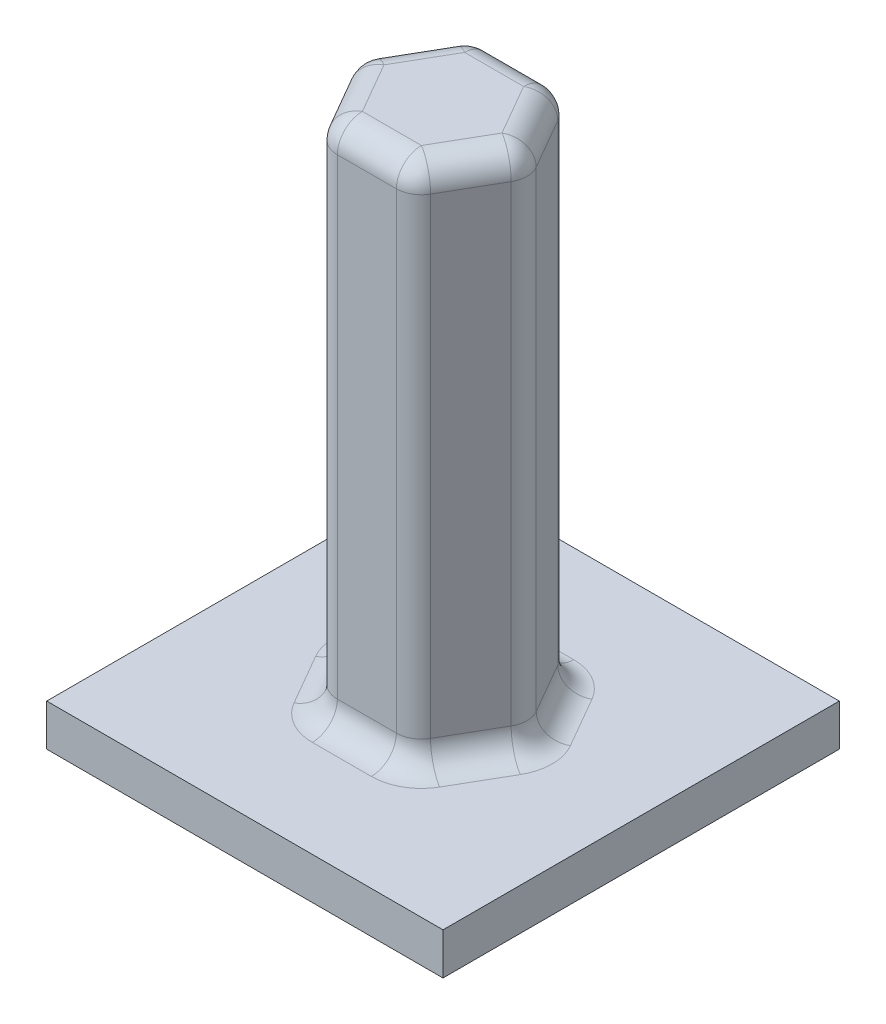
ISO-10303-21;
HEADER;
FILE_DESCRIPTION(('STEP AP214'),'2;1');
FILE_NAME('part.step','',(''),(''),'','','');
FILE_SCHEMA(('AUTOMOTIVE_DESIGN { 1 0 10303 214 1 1 1 1 }'));
ENDSEC;
DATA;
#1=APPLICATION_CONTEXT('core data for automotive mechanical design processes');
#2=APPLICATION_PROTOCOL_DEFINITION('international standard','automotive_design',2000,#1);
#3=PRODUCT_CONTEXT('',#1,'mechanical');
#4=PRODUCT('Part','Part','',(#3));
#5=PRODUCT_RELATED_PRODUCT_CATEGORY('part','',(#4));
#6=PRODUCT_DEFINITION_FORMATION('','',#4);
#7=PRODUCT_DEFINITION_CONTEXT('part definition',#1,'design');
#8=PRODUCT_DEFINITION('design','',#6,#7);
#9=PRODUCT_DEFINITION_SHAPE('','',#8);
#10=(LENGTH_UNIT() NAMED_UNIT(*) SI_UNIT(.MILLI.,.METRE.));
#11=(NAMED_UNIT(*) PLANE_ANGLE_UNIT() SI_UNIT($,.RADIAN.));
#12=(NAMED_UNIT(*) SI_UNIT($,.STERADIAN.) SOLID_ANGLE_UNIT());
#13=UNCERTAINTY_MEASURE_WITH_UNIT(LENGTH_MEASURE(1.E-05),#10,'distance_accuracy_value','');
#14=(GEOMETRIC_REPRESENTATION_CONTEXT(3) GLOBAL_UNCERTAINTY_ASSIGNED_CONTEXT((#13)) GLOBAL_UNIT_ASSIGNED_CONTEXT((#10,
#11,#12)) REPRESENTATION_CONTEXT('',''));
#15=CARTESIAN_POINT('',(0.,0.,0.));
#16=DIRECTION('',(0.,0.,1.));
#17=DIRECTION('',(1.,0.,0.));
#18=AXIS2_PLACEMENT_3D('',#15,#16,#17);
#19=CARTESIAN_POINT('',(0.,2.,0.));
#20=DIRECTION('',(0.,-1.,0.));
#21=DIRECTION('',(0.,0.,-1.));
#22=AXIS2_PLACEMENT_3D('',#19,#20,#21);
#23=PLANE('',#22);
#24=CARTESIAN_POINT('',(-2.82901631902917,2.,0.));
#25=DIRECTION('',(0.,-1.,0.));
#26=DIRECTION('',(0.,0.,-1.));
#27=AXIS2_PLACEMENT_3D('',#24,#25,#26);
#28=CIRCLE('',#27,2.4);
#29=CARTESIAN_POINT('',(-4.90747728811182,2.,-1.2));
#30=VERTEX_POINT('',#29);
#31=CARTESIAN_POINT('',(-4.90747728811182,2.,1.2));
#32=VERTEX_POINT('',#31);
#33=EDGE_CURVE('E253',#30,#32,#28,.F.);
#34=ORIENTED_EDGE('',*,*,#33,.F.);
#35=DIRECTION('',(-0.5,0.,0.866025403784439));
#36=VECTOR('',#35,1.);
#37=CARTESIAN_POINT('',(-3.14655896708346,2.,-4.25));
#38=LINE('',#37,#36);
#39=CARTESIAN_POINT('',(-3.49296912859723,2.,-3.65));
#40=VERTEX_POINT('',#39);
#41=EDGE_CURVE('E280',#30,#40,#38,.F.);
#42=ORIENTED_EDGE('',*,*,#41,.T.);
#43=CARTESIAN_POINT('',(-1.41450815951458,2.,-2.45));
#44=DIRECTION('',(0.,-1.,0.));
#45=DIRECTION('',(0.,0.,-1.));
#46=AXIS2_PLACEMENT_3D('',#43,#44,#45);
#47=CIRCLE('',#46,2.4);
#48=CARTESIAN_POINT('',(-1.41450815951458,2.,-4.85));
#49=VERTEX_POINT('',#48);
#50=EDGE_CURVE('E278',#49,#40,#47,.F.);
#51=ORIENTED_EDGE('',*,*,#50,.F.);
#52=DIRECTION('',(-1.,0.,0.));
#53=VECTOR('',#52,1.);
#54=CARTESIAN_POINT('',(2.10732848254213,2.,-4.85));
#55=LINE('',#54,#53);
#56=CARTESIAN_POINT('',(1.41450815951458,2.,-4.85));
#57=VERTEX_POINT('',#56);
#58=EDGE_CURVE('E276',#49,#57,#55,.F.);
#59=ORIENTED_EDGE('',*,*,#58,.T.);
#60=CARTESIAN_POINT('',(1.41450815951458,2.,-2.45));
#61=DIRECTION('',(0.,-1.,0.));
#62=DIRECTION('',(0.,0.,-1.));
#63=AXIS2_PLACEMENT_3D('',#60,#61,#62);
#64=CIRCLE('',#63,2.4);
#65=CARTESIAN_POINT('',(3.49296912859723,2.,-3.65));
#66=VERTEX_POINT('',#65);
#67=EDGE_CURVE('E273',#66,#57,#64,.F.);
#68=ORIENTED_EDGE('',*,*,#67,.F.);
#69=DIRECTION('',(-0.5,0.,-0.866025403784439));
#70=VECTOR('',#69,1.);
#71=CARTESIAN_POINT('',(5.2538874496256,2.,-0.6));
#72=LINE('',#71,#70);
#73=CARTESIAN_POINT('',(4.90747728811182,2.,-1.2));
#74=VERTEX_POINT('',#73);
#75=EDGE_CURVE('E271',#66,#74,#72,.F.);
#76=ORIENTED_EDGE('',*,*,#75,.T.);
#77=CARTESIAN_POINT('',(2.82901631902917,2.,0.));
#78=DIRECTION('',(0.,-1.,0.));
#79=DIRECTION('',(0.,0.,-1.));
#80=AXIS2_PLACEMENT_3D('',#77,#78,#79);
#81=CIRCLE('',#80,2.4);
#82=CARTESIAN_POINT('',(4.90747728811182,2.,1.2));
#83=VERTEX_POINT('',#82);
#84=EDGE_CURVE('E268',#83,#74,#81,.F.);
#85=ORIENTED_EDGE('',*,*,#84,.F.);
#86=DIRECTION('',(0.5,0.,-0.866025403784439));
#87=VECTOR('',#86,1.);
#88=CARTESIAN_POINT('',(3.14655896708346,2.,4.25));
#89=LINE('',#88,#87);
#90=CARTESIAN_POINT('',(3.49296912859724,2.,3.65));
#91=VERTEX_POINT('',#90);
#92=EDGE_CURVE('E266',#83,#91,#89,.F.);
#93=ORIENTED_EDGE('',*,*,#92,.T.);
#94=CARTESIAN_POINT('',(1.41450815951459,2.,2.45));
#95=DIRECTION('',(0.,-1.,0.));
#96=DIRECTION('',(0.,0.,-1.));
#97=AXIS2_PLACEMENT_3D('',#94,#95,#96);
#98=CIRCLE('',#97,2.4);
#99=CARTESIAN_POINT('',(1.41450815951459,2.,4.85));
#100=VERTEX_POINT('',#99);
#101=EDGE_CURVE('E263',#100,#91,#98,.F.);
#102=ORIENTED_EDGE('',*,*,#101,.F.);
#103=DIRECTION('',(1.,0.,0.));
#104=VECTOR('',#103,1.);
#105=CARTESIAN_POINT('',(-2.10732848254213,2.,4.85));
#106=LINE('',#105,#104);
#107=CARTESIAN_POINT('',(-1.41450815951458,2.,4.85));
#108=VERTEX_POINT('',#107);
#109=EDGE_CURVE('E261',#100,#108,#106,.F.);
#110=ORIENTED_EDGE('',*,*,#109,.T.);
#111=CARTESIAN_POINT('',(-1.41450815951458,2.,2.45));
#112=DIRECTION('',(0.,-1.,0.));
#113=DIRECTION('',(0.,0.,-1.));
#114=AXIS2_PLACEMENT_3D('',#111,#112,#113);
#115=CIRCLE('',#114,2.4);
#116=CARTESIAN_POINT('',(-3.49296912859723,2.,3.65));
#117=VERTEX_POINT('',#116);
#118=EDGE_CURVE('E258',#117,#108,#115,.F.);
#119=ORIENTED_EDGE('',*,*,#118,.F.);
#120=DIRECTION('',(0.5,0.,0.866025403784439));
#121=VECTOR('',#120,1.);
#122=CARTESIAN_POINT('',(-5.25388744962559,2.,0.599999999999999));
#123=LINE('',#122,#121);
#124=EDGE_CURVE('E256',#117,#32,#123,.F.);
#125=ORIENTED_EDGE('',*,*,#124,.T.);
#126=EDGE_LOOP('',(#34,#42,#51,#59,#68,#76,#85,#93,#102,#110,#119,#125));
#127=FACE_BOUND('',#126,.T.);
#128=DIRECTION('',(0.,0.,-1.));
#129=VECTOR('',#128,1.);
#130=CARTESIAN_POINT('',(9.5,2.,9.5));
#131=LINE('',#130,#129);
#132=CARTESIAN_POINT('',(9.5,2.,9.5));
#133=VERTEX_POINT('',#132);
#134=CARTESIAN_POINT('',(9.5,2.,-9.5));
#135=VERTEX_POINT('',#134);
#136=EDGE_CURVE('E213',#133,#135,#131,.T.);
#137=ORIENTED_EDGE('',*,*,#136,.T.);
#138=DIRECTION('',(-1.,0.,0.));
#139=VECTOR('',#138,1.);
#140=CARTESIAN_POINT('',(-9.5,2.,-9.5));
#141=LINE('',#140,#139);
#142=CARTESIAN_POINT('',(-9.5,2.,-9.5));
#143=VERTEX_POINT('',#142);
#144=EDGE_CURVE('E202',#135,#143,#141,.T.);
#145=ORIENTED_EDGE('',*,*,#144,.T.);
#146=DIRECTION('',(0.,0.,1.));
#147=VECTOR('',#146,1.);
#148=CARTESIAN_POINT('',(-9.5,2.,9.5));
#149=LINE('',#148,#147);
#150=CARTESIAN_POINT('',(-9.5,2.,9.5));
#151=VERTEX_POINT('',#150);
#152=EDGE_CURVE('E212',#143,#151,#149,.T.);
#153=ORIENTED_EDGE('',*,*,#152,.T.);
#154=DIRECTION('',(1.,0.,0.));
#155=VECTOR('',#154,1.);
#156=CARTESIAN_POINT('',(-9.5,2.,9.5));
#157=LINE('',#156,#155);
#158=EDGE_CURVE('E217',#151,#133,#157,.T.);
#159=ORIENTED_EDGE('',*,*,#158,.T.);
#160=EDGE_LOOP('',(#137,#145,#153,#159));
#161=FACE_BOUND('',#160,.T.);
#162=ADVANCED_FACE('F35',(#127,#161),#23,.F.);
#163=CARTESIAN_POINT('',(9.5,2.,9.5));
#164=DIRECTION('',(-1.,0.,0.));
#165=DIRECTION('',(0.,0.,1.));
#166=AXIS2_PLACEMENT_3D('',#163,#164,#165);
#167=PLANE('',#166);
#168=DIRECTION('',(0.,0.,-1.));
#169=VECTOR('',#168,1.);
#170=CARTESIAN_POINT('',(9.5,0.,9.5));
#171=LINE('',#170,#169);
#172=CARTESIAN_POINT('',(9.5,0.,9.5));
#173=VERTEX_POINT('',#172);
#174=CARTESIAN_POINT('',(9.5,0.,-9.5));
#175=VERTEX_POINT('',#174);
#176=EDGE_CURVE('E225',#173,#175,#171,.T.);
#177=ORIENTED_EDGE('',*,*,#176,.T.);
#178=DIRECTION('',(0.,-1.,0.));
#179=VECTOR('',#178,1.);
#180=CARTESIAN_POINT('',(9.5,2.,-9.5));
#181=LINE('',#180,#179);
#182=EDGE_CURVE('E206',#135,#175,#181,.T.);
#183=ORIENTED_EDGE('',*,*,#182,.F.);
#184=ORIENTED_EDGE('',*,*,#136,.F.);
#185=DIRECTION('',(0.,-1.,0.));
#186=VECTOR('',#185,1.);
#187=CARTESIAN_POINT('',(9.5,2.,9.5));
#188=LINE('',#187,#186);
#189=EDGE_CURVE('E435',#133,#173,#188,.T.);
#190=ORIENTED_EDGE('',*,*,#189,.T.);
#191=EDGE_LOOP('',(#177,#183,#184,#190));
#192=FACE_BOUND('',#191,.T.);
#193=ADVANCED_FACE('F223',(#192),#167,.F.);
#194=CARTESIAN_POINT('',(-9.5,2.,-9.5));
#195=DIRECTION('',(0.,0.,1.));
#196=DIRECTION('',(1.,0.,0.));
#197=AXIS2_PLACEMENT_3D('',#194,#195,#196);
#198=PLANE('',#197);
#199=DIRECTION('',(-1.,0.,0.));
#200=VECTOR('',#199,1.);
#201=CARTESIAN_POINT('',(-9.5,0.,-9.5));
#202=LINE('',#201,#200);
#203=CARTESIAN_POINT('',(-9.5,0.,-9.5));
#204=VERTEX_POINT('',#203);
#205=EDGE_CURVE('E426',#175,#204,#202,.T.);
#206=ORIENTED_EDGE('',*,*,#205,.T.);
#207=DIRECTION('',(0.,-1.,0.));
#208=VECTOR('',#207,1.);
#209=CARTESIAN_POINT('',(-9.5,2.,-9.5));
#210=LINE('',#209,#208);
#211=EDGE_CURVE('E209',#143,#204,#210,.T.);
#212=ORIENTED_EDGE('',*,*,#211,.F.);
#213=ORIENTED_EDGE('',*,*,#144,.F.);
#214=ORIENTED_EDGE('',*,*,#182,.T.);
#215=EDGE_LOOP('',(#206,#212,#213,#214));
#216=FACE_BOUND('',#215,.T.);
#217=ADVANCED_FACE('F204',(#216),#198,.F.);
#218=CARTESIAN_POINT('',(-9.5,2.,9.5));
#219=DIRECTION('',(1.,0.,0.));
#220=DIRECTION('',(0.,0.,-1.));
#221=AXIS2_PLACEMENT_3D('',#218,#219,#220);
#222=PLANE('',#221);
#223=DIRECTION('',(0.,0.,1.));
#224=VECTOR('',#223,1.);
#225=CARTESIAN_POINT('',(-9.5,0.,9.5));
#226=LINE('',#225,#224);
#227=CARTESIAN_POINT('',(-9.5,0.,9.5));
#228=VERTEX_POINT('',#227);
#229=EDGE_CURVE('E428',#204,#228,#226,.T.);
#230=ORIENTED_EDGE('',*,*,#229,.T.);
#231=DIRECTION('',(0.,-1.,0.));
#232=VECTOR('',#231,1.);
#233=CARTESIAN_POINT('',(-9.5,2.,9.5));
#234=LINE('',#233,#232);
#235=EDGE_CURVE('E230',#151,#228,#234,.T.);
#236=ORIENTED_EDGE('',*,*,#235,.F.);
#237=ORIENTED_EDGE('',*,*,#152,.F.);
#238=ORIENTED_EDGE('',*,*,#211,.T.);
#239=EDGE_LOOP('',(#230,#236,#237,#238));
#240=FACE_BOUND('',#239,.T.);
#241=ADVANCED_FACE('F445',(#240),#222,.F.);
#242=CARTESIAN_POINT('',(-9.5,2.,9.5));
#243=DIRECTION('',(0.,0.,-1.));
#244=DIRECTION('',(-1.,0.,0.));
#245=AXIS2_PLACEMENT_3D('',#242,#243,#244);
#246=PLANE('',#245);
#247=DIRECTION('',(1.,0.,0.));
#248=VECTOR('',#247,1.);
#249=CARTESIAN_POINT('',(-9.5,0.,9.5));
#250=LINE('',#249,#248);
#251=EDGE_CURVE('E221',#228,#173,#250,.T.);
#252=ORIENTED_EDGE('',*,*,#251,.T.);
#253=ORIENTED_EDGE('',*,*,#189,.F.);
#254=ORIENTED_EDGE('',*,*,#158,.F.);
#255=ORIENTED_EDGE('',*,*,#235,.T.);
#256=EDGE_LOOP('',(#252,#253,#254,#255));
#257=FACE_BOUND('',#256,.T.);
#258=ADVANCED_FACE('F440',(#257),#246,.F.);
#259=CARTESIAN_POINT('',(0.,0.,0.));
#260=DIRECTION('',(0.,-1.,0.));
#261=DIRECTION('',(0.,0.,-1.));
#262=AXIS2_PLACEMENT_3D('',#259,#260,#261);
#263=PLANE('',#262);
#264=ORIENTED_EDGE('',*,*,#176,.F.);
#265=ORIENTED_EDGE('',*,*,#251,.F.);
#266=ORIENTED_EDGE('',*,*,#229,.F.);
#267=ORIENTED_EDGE('',*,*,#205,.F.);
#268=EDGE_LOOP('',(#264,#265,#266,#267));
#269=FACE_BOUND('',#268,.T.);
#270=ADVANCED_FACE('F444',(#269),#263,.T.);
#271=CARTESIAN_POINT('',(2.10732848254214,27.,3.65));
#272=DIRECTION('',(-0.866025403784439,0.,-0.5));
#273=DIRECTION('',(-0.5,0.,0.866025403784439));
#274=AXIS2_PLACEMENT_3D('',#271,#272,#273);
#275=PLANE('',#274);
#276=DIRECTION('',(0.,-1.,0.));
#277=VECTOR('',#276,1.);
#278=CARTESIAN_POINT('',(3.86824680357049,27.,0.600000000000001));
#279=LINE('',#278,#277);
#280=CARTESIAN_POINT('',(3.86824680357049,3.2,0.600000000000001));
#281=VERTEX_POINT('',#280);
#282=CARTESIAN_POINT('',(3.86824680357049,25.8,0.600000000000001));
#283=VERTEX_POINT('',#282);
#284=EDGE_CURVE('E305',#281,#283,#279,.F.);
#285=ORIENTED_EDGE('',*,*,#284,.T.);
#286=DIRECTION('',(0.5,0.,-0.866025403784439));
#287=VECTOR('',#286,1.);
#288=CARTESIAN_POINT('',(2.10732848254214,25.8,3.65));
#289=LINE('',#288,#287);
#290=CARTESIAN_POINT('',(2.45373864405591,25.8,3.05));
#291=VERTEX_POINT('',#290);
#292=EDGE_CURVE('E307',#283,#291,#289,.F.);
#293=ORIENTED_EDGE('',*,*,#292,.T.);
#294=DIRECTION('',(0.,-1.,0.));
#295=VECTOR('',#294,1.);
#296=CARTESIAN_POINT('',(2.45373864405591,27.,3.05));
#297=LINE('',#296,#295);
#298=CARTESIAN_POINT('',(2.45373864405591,3.2,3.05));
#299=VERTEX_POINT('',#298);
#300=EDGE_CURVE('E301',#291,#299,#297,.T.);
#301=ORIENTED_EDGE('',*,*,#300,.T.);
#302=DIRECTION('',(0.5,0.,-0.866025403784439));
#303=VECTOR('',#302,1.);
#304=CARTESIAN_POINT('',(4.21465696508427,3.2,0.));
#305=LINE('',#304,#303);
#306=EDGE_CURVE('E303',#299,#281,#305,.T.);
#307=ORIENTED_EDGE('',*,*,#306,.T.);
#308=EDGE_LOOP('',(#285,#293,#301,#307));
#309=FACE_BOUND('',#308,.T.);
#310=ADVANCED_FACE('F463',(#309),#275,.F.);
#311=CARTESIAN_POINT('',(4.21465696508427,27.,0.));
#312=DIRECTION('',(-0.866025403784438,0.,0.5));
#313=DIRECTION('',(0.5,0.,0.866025403784439));
#314=AXIS2_PLACEMENT_3D('',#311,#312,#313);
#315=PLANE('',#314);
#316=DIRECTION('',(0.,-1.,0.));
#317=VECTOR('',#316,1.);
#318=CARTESIAN_POINT('',(2.45373864405591,27.,-3.05));
#319=LINE('',#318,#317);
#320=CARTESIAN_POINT('',(2.45373864405591,3.2,-3.05));
#321=VERTEX_POINT('',#320);
#322=CARTESIAN_POINT('',(2.45373864405591,25.8,-3.05));
#323=VERTEX_POINT('',#322);
#324=EDGE_CURVE('E296',#321,#323,#319,.F.);
#325=ORIENTED_EDGE('',*,*,#324,.T.);
#326=DIRECTION('',(-0.5,0.,-0.866025403784439));
#327=VECTOR('',#326,1.);
#328=CARTESIAN_POINT('',(4.21465696508427,25.8,0.));
#329=LINE('',#328,#327);
#330=CARTESIAN_POINT('',(3.86824680357049,25.8,-0.6));
#331=VERTEX_POINT('',#330);
#332=EDGE_CURVE('E298',#323,#331,#329,.F.);
#333=ORIENTED_EDGE('',*,*,#332,.T.);
#334=DIRECTION('',(0.,-1.,0.));
#335=VECTOR('',#334,1.);
#336=CARTESIAN_POINT('',(3.86824680357049,27.,-0.6));
#337=LINE('',#336,#335);
#338=CARTESIAN_POINT('',(3.86824680357049,3.2,-0.6));
#339=VERTEX_POINT('',#338);
#340=EDGE_CURVE('E292',#331,#339,#337,.T.);
#341=ORIENTED_EDGE('',*,*,#340,.T.);
#342=DIRECTION('',(-0.5,0.,-0.866025403784439));
#343=VECTOR('',#342,1.);
#344=CARTESIAN_POINT('',(2.10732848254213,3.2,-3.65));
#345=LINE('',#344,#343);
#346=EDGE_CURVE('E294',#339,#321,#345,.T.);
#347=ORIENTED_EDGE('',*,*,#346,.T.);
#348=EDGE_LOOP('',(#325,#333,#341,#347));
#349=FACE_BOUND('',#348,.T.);
#350=ADVANCED_FACE('F469',(#349),#315,.F.);
#351=CARTESIAN_POINT('',(2.10732848254213,27.,-3.65));
#352=DIRECTION('',(0.,0.,1.));
#353=DIRECTION('',(1.,0.,0.));
#354=AXIS2_PLACEMENT_3D('',#351,#352,#353);
#355=PLANE('',#354);
#356=DIRECTION('',(0.,-1.,0.));
#357=VECTOR('',#356,1.);
#358=CARTESIAN_POINT('',(-1.41450815951458,27.,-3.65));
#359=LINE('',#358,#357);
#360=CARTESIAN_POINT('',(-1.41450815951458,3.2,-3.65));
#361=VERTEX_POINT('',#360);
#362=CARTESIAN_POINT('',(-1.41450815951458,25.8,-3.65));
#363=VERTEX_POINT('',#362);
#364=EDGE_CURVE('E287',#361,#363,#359,.F.);
#365=ORIENTED_EDGE('',*,*,#364,.T.);
#366=DIRECTION('',(-1.,0.,0.));
#367=VECTOR('',#366,1.);
#368=CARTESIAN_POINT('',(2.10732848254213,25.8,-3.65));
#369=LINE('',#368,#367);
#370=CARTESIAN_POINT('',(1.41450815951458,25.8,-3.65));
#371=VERTEX_POINT('',#370);
#372=EDGE_CURVE('E289',#363,#371,#369,.F.);
#373=ORIENTED_EDGE('',*,*,#372,.T.);
#374=DIRECTION('',(0.,-1.,0.));
#375=VECTOR('',#374,1.);
#376=CARTESIAN_POINT('',(1.41450815951458,27.,-3.65));
#377=LINE('',#376,#375);
#378=CARTESIAN_POINT('',(1.41450815951458,3.2,-3.65));
#379=VERTEX_POINT('',#378);
#380=EDGE_CURVE('E283',#371,#379,#377,.T.);
#381=ORIENTED_EDGE('',*,*,#380,.T.);
#382=DIRECTION('',(-1.,0.,0.));
#383=VECTOR('',#382,1.);
#384=CARTESIAN_POINT('',(-2.10732848254213,3.2,-3.65));
#385=LINE('',#384,#383);
#386=EDGE_CURVE('E285',#379,#361,#385,.T.);
#387=ORIENTED_EDGE('',*,*,#386,.T.);
#388=EDGE_LOOP('',(#365,#373,#381,#387));
#389=FACE_BOUND('',#388,.T.);
#390=ADVANCED_FACE('F474',(#389),#355,.F.);
#391=CARTESIAN_POINT('',(-2.10732848254213,27.,-3.65));
#392=DIRECTION('',(0.866025403784438,0.,0.5));
#393=DIRECTION('',(0.5,0.,-0.866025403784439));
#394=AXIS2_PLACEMENT_3D('',#391,#392,#393);
#395=PLANE('',#394);
#396=DIRECTION('',(-0.5,0.,0.866025403784439));
#397=VECTOR('',#396,1.);
#398=CARTESIAN_POINT('',(-2.10732848254213,25.8,-3.65));
#399=LINE('',#398,#397);
#400=CARTESIAN_POINT('',(-3.86824680357049,25.8,-0.600000000000002));
#401=VERTEX_POINT('',#400);
#402=CARTESIAN_POINT('',(-2.45373864405591,25.8,-3.05));
#403=VERTEX_POINT('',#402);
#404=EDGE_CURVE('E248',#401,#403,#399,.F.);
#405=ORIENTED_EDGE('',*,*,#404,.T.);
#406=DIRECTION('',(0.,-1.,0.));
#407=VECTOR('',#406,1.);
#408=CARTESIAN_POINT('',(-2.45373864405591,27.,-3.05));
#409=LINE('',#408,#407);
#410=CARTESIAN_POINT('',(-2.45373864405591,3.2,-3.05));
#411=VERTEX_POINT('',#410);
#412=EDGE_CURVE('E251',#403,#411,#409,.T.);
#413=ORIENTED_EDGE('',*,*,#412,.T.);
#414=DIRECTION('',(-0.5,0.,0.866025403784439));
#415=VECTOR('',#414,1.);
#416=CARTESIAN_POINT('',(-4.21465696508427,3.2,0.));
#417=LINE('',#416,#415);
#418=CARTESIAN_POINT('',(-3.86824680357049,3.2,-0.600000000000002));
#419=VERTEX_POINT('',#418);
#420=EDGE_CURVE('E246',#411,#419,#417,.T.);
#421=ORIENTED_EDGE('',*,*,#420,.T.);
#422=DIRECTION('',(0.,-1.,0.));
#423=VECTOR('',#422,1.);
#424=CARTESIAN_POINT('',(-3.86824680357049,27.,-0.600000000000002));
#425=LINE('',#424,#423);
#426=EDGE_CURVE('E244',#419,#401,#425,.F.);
#427=ORIENTED_EDGE('',*,*,#426,.T.);
#428=EDGE_LOOP('',(#405,#413,#421,#427));
#429=FACE_BOUND('',#428,.T.);
#430=ADVANCED_FACE('F794',(#429),#395,.F.);
#431=CARTESIAN_POINT('',(-4.21465696508427,27.,0.));
#432=DIRECTION('',(0.866025403784438,0.,-0.5));
#433=DIRECTION('',(-0.5,0.,-0.866025403784439));
#434=AXIS2_PLACEMENT_3D('',#431,#432,#433);
#435=PLANE('',#434);
#436=DIRECTION('',(0.5,0.,0.866025403784439));
#437=VECTOR('',#436,1.);
#438=CARTESIAN_POINT('',(-4.21465696508427,25.8,0.));
#439=LINE('',#438,#437);
#440=CARTESIAN_POINT('',(-2.45373864405591,25.8,3.05));
#441=VERTEX_POINT('',#440);
#442=CARTESIAN_POINT('',(-3.86824680357049,25.8,0.599999999999998));
#443=VERTEX_POINT('',#442);
#444=EDGE_CURVE('E44',#441,#443,#439,.F.);
#445=ORIENTED_EDGE('',*,*,#444,.T.);
#446=DIRECTION('',(0.,-1.,0.));
#447=VECTOR('',#446,1.);
#448=CARTESIAN_POINT('',(-3.86824680357049,27.,0.599999999999998));
#449=LINE('',#448,#447);
#450=CARTESIAN_POINT('',(-3.86824680357049,3.2,0.599999999999998));
#451=VERTEX_POINT('',#450);
#452=EDGE_CURVE('E11',#443,#451,#449,.T.);
#453=ORIENTED_EDGE('',*,*,#452,.T.);
#454=DIRECTION('',(0.5,0.,0.866025403784439));
#455=VECTOR('',#454,1.);
#456=CARTESIAN_POINT('',(-2.10732848254213,3.2,3.65));
#457=LINE('',#456,#455);
#458=CARTESIAN_POINT('',(-2.45373864405591,3.2,3.05));
#459=VERTEX_POINT('',#458);
#460=EDGE_CURVE('E319',#451,#459,#457,.T.);
#461=ORIENTED_EDGE('',*,*,#460,.T.);
#462=DIRECTION('',(0.,-1.,0.));
#463=VECTOR('',#462,1.);
#464=CARTESIAN_POINT('',(-2.45373864405591,27.,3.05));
#465=LINE('',#464,#463);
#466=EDGE_CURVE('E55',#459,#441,#465,.F.);
#467=ORIENTED_EDGE('',*,*,#466,.T.);
#468=EDGE_LOOP('',(#445,#453,#461,#467));
#469=FACE_BOUND('',#468,.T.);
#470=ADVANCED_FACE('F785',(#469),#435,.F.);
#471=CARTESIAN_POINT('',(-2.10732848254213,27.,3.65));
#472=DIRECTION('',(0.,0.,-1.));
#473=DIRECTION('',(-1.,0.,0.));
#474=AXIS2_PLACEMENT_3D('',#471,#472,#473);
#475=PLANE('',#474);
#476=DIRECTION('',(0.,-1.,0.));
#477=VECTOR('',#476,1.);
#478=CARTESIAN_POINT('',(1.41450815951459,27.,3.65));
#479=LINE('',#478,#477);
#480=CARTESIAN_POINT('',(1.41450815951459,3.2,3.65));
#481=VERTEX_POINT('',#480);
#482=CARTESIAN_POINT('',(1.41450815951459,25.8,3.65));
#483=VERTEX_POINT('',#482);
#484=EDGE_CURVE('E314',#481,#483,#479,.F.);
#485=ORIENTED_EDGE('',*,*,#484,.T.);
#486=DIRECTION('',(1.,0.,0.));
#487=VECTOR('',#486,1.);
#488=CARTESIAN_POINT('',(-2.10732848254213,25.8,3.65));
#489=LINE('',#488,#487);
#490=CARTESIAN_POINT('',(-1.41450815951458,25.8,3.65));
#491=VERTEX_POINT('',#490);
#492=EDGE_CURVE('E316',#483,#491,#489,.F.);
#493=ORIENTED_EDGE('',*,*,#492,.T.);
#494=DIRECTION('',(0.,-1.,0.));
#495=VECTOR('',#494,1.);
#496=CARTESIAN_POINT('',(-1.41450815951458,27.,3.65));
#497=LINE('',#496,#495);
#498=CARTESIAN_POINT('',(-1.41450815951458,3.2,3.65));
#499=VERTEX_POINT('',#498);
#500=EDGE_CURVE('E310',#491,#499,#497,.T.);
#501=ORIENTED_EDGE('',*,*,#500,.T.);
#502=DIRECTION('',(1.,0.,0.));
#503=VECTOR('',#502,1.);
#504=CARTESIAN_POINT('',(2.10732848254214,3.2,3.65));
#505=LINE('',#504,#503);
#506=EDGE_CURVE('E312',#499,#481,#505,.T.);
#507=ORIENTED_EDGE('',*,*,#506,.T.);
#508=EDGE_LOOP('',(#485,#493,#501,#507));
#509=FACE_BOUND('',#508,.T.);
#510=ADVANCED_FACE('F513',(#509),#475,.F.);
#511=CARTESIAN_POINT('',(0.,27.,0.));
#512=DIRECTION('',(0.,1.,0.));
#513=DIRECTION('',(0.,0.,1.));
#514=AXIS2_PLACEMENT_3D('',#511,#512,#513);
#515=PLANE('',#514);
#516=DIRECTION('',(-1.,0.,0.));
#517=VECTOR('',#516,1.);
#518=CARTESIAN_POINT('',(-2.10732848254213,27.,-2.45));
#519=LINE('',#518,#517);
#520=CARTESIAN_POINT('',(1.41450815951458,27.,-2.45));
#521=VERTEX_POINT('',#520);
#522=CARTESIAN_POINT('',(-1.41450815951458,27.,-2.45));
#523=VERTEX_POINT('',#522);
#524=EDGE_CURVE('E239',#521,#523,#519,.T.);
#525=ORIENTED_EDGE('',*,*,#524,.T.);
#526=DIRECTION('',(-0.5,0.,0.866025403784439));
#527=VECTOR('',#526,1.);
#528=CARTESIAN_POINT('',(-3.17542648054294,27.,0.599999999999999));
#529=LINE('',#528,#527);
#530=CARTESIAN_POINT('',(-2.82901631902917,27.,0.));
#531=VERTEX_POINT('',#530);
#532=EDGE_CURVE('E241',#523,#531,#529,.T.);
#533=ORIENTED_EDGE('',*,*,#532,.T.);
#534=DIRECTION('',(0.5,0.,0.866025403784439));
#535=VECTOR('',#534,1.);
#536=CARTESIAN_POINT('',(-1.06809799800081,27.,3.05));
#537=LINE('',#536,#535);
#538=CARTESIAN_POINT('',(-1.41450815951458,27.,2.45));
#539=VERTEX_POINT('',#538);
#540=EDGE_CURVE('E226',#531,#539,#537,.T.);
#541=ORIENTED_EDGE('',*,*,#540,.T.);
#542=DIRECTION('',(1.,0.,0.));
#543=VECTOR('',#542,1.);
#544=CARTESIAN_POINT('',(2.10732848254214,27.,2.45));
#545=LINE('',#544,#543);
#546=CARTESIAN_POINT('',(1.41450815951458,27.,2.45));
#547=VERTEX_POINT('',#546);
#548=EDGE_CURVE('E228',#539,#547,#545,.T.);
#549=ORIENTED_EDGE('',*,*,#548,.T.);
#550=DIRECTION('',(0.5,0.,-0.866025403784439));
#551=VECTOR('',#550,1.);
#552=CARTESIAN_POINT('',(3.17542648054294,27.,-0.6));
#553=LINE('',#552,#551);
#554=CARTESIAN_POINT('',(2.82901631902917,27.,0.));
#555=VERTEX_POINT('',#554);
#556=EDGE_CURVE('E235',#547,#555,#553,.T.);
#557=ORIENTED_EDGE('',*,*,#556,.T.);
#558=DIRECTION('',(-0.5,0.,-0.866025403784439));
#559=VECTOR('',#558,1.);
#560=CARTESIAN_POINT('',(1.06809799800081,27.,-3.05));
#561=LINE('',#560,#559);
#562=EDGE_CURVE('E237',#555,#521,#561,.T.);
#563=ORIENTED_EDGE('',*,*,#562,.T.);
#564=EDGE_LOOP('',(#525,#533,#541,#549,#557,#563));
#565=FACE_BOUND('',#564,.T.);
#566=ADVANCED_FACE('F499',(#565),#515,.T.);
#567=CARTESIAN_POINT('',(3.14655896708346,3.2,4.25));
#568=DIRECTION('',(-0.5,0.,0.866025403784439));
#569=DIRECTION('',(0.866025403784439,0.,0.5));
#570=AXIS2_PLACEMENT_3D('',#567,#568,#569);
#571=CYLINDRICAL_SURFACE('',#570,1.2);
#572=CARTESIAN_POINT('',(3.49296912859724,3.2,3.65));
#573=DIRECTION('',(0.5,0.,-0.866025403784439));
#574=DIRECTION('',(-0.866025403784439,0.,-0.5));
#575=AXIS2_PLACEMENT_3D('',#572,#573,#574);
#576=CIRCLE('',#575,1.2);
#577=EDGE_CURVE('E417',#91,#299,#576,.T.);
#578=ORIENTED_EDGE('',*,*,#577,.F.);
#579=ORIENTED_EDGE('',*,*,#92,.F.);
#580=CARTESIAN_POINT('',(4.90747728811182,3.2,1.2));
#581=DIRECTION('',(-0.5,0.,0.866025403784438));
#582=DIRECTION('',(0.866025403784439,0.,0.5));
#583=AXIS2_PLACEMENT_3D('',#580,#581,#582);
#584=CIRCLE('',#583,1.2);
#585=EDGE_CURVE('E39',#281,#83,#584,.T.);
#586=ORIENTED_EDGE('',*,*,#585,.F.);
#587=ORIENTED_EDGE('',*,*,#306,.F.);
#588=EDGE_LOOP('',(#578,#579,#586,#587));
#589=FACE_BOUND('',#588,.T.);
#590=ADVANCED_FACE('F37',(#589),#571,.F.);
#591=CARTESIAN_POINT('',(2.82901631902917,3.2,0.));
#592=DIRECTION('',(0.,-1.,0.));
#593=DIRECTION('',(0.,0.,-1.));
#594=AXIS2_PLACEMENT_3D('',#591,#592,#593);
#595=TOROIDAL_SURFACE('',#594,2.4,1.2);
#596=ORIENTED_EDGE('',*,*,#585,.T.);
#597=ORIENTED_EDGE('',*,*,#84,.T.);
#598=CARTESIAN_POINT('',(4.90747728811182,3.2,-1.2));
#599=DIRECTION('',(-0.5,0.,-0.866025403784438));
#600=DIRECTION('',(-0.866025403784438,0.,0.500000000000001));
#601=AXIS2_PLACEMENT_3D('',#598,#599,#600);
#602=CIRCLE('',#601,1.2);
#603=EDGE_CURVE('E415',#339,#74,#602,.F.);
#604=ORIENTED_EDGE('',*,*,#603,.F.);
#605=CARTESIAN_POINT('',(2.82901631902917,3.2,0.));
#606=DIRECTION('',(0.,-1.,0.));
#607=DIRECTION('',(0.,0.,-1.));
#608=AXIS2_PLACEMENT_3D('',#605,#606,#607);
#609=CIRCLE('',#608,1.2);
#610=EDGE_CURVE('E412',#281,#339,#609,.F.);
#611=ORIENTED_EDGE('',*,*,#610,.F.);
#612=EDGE_LOOP('',(#596,#597,#604,#611));
#613=FACE_BOUND('',#612,.T.);
#614=ADVANCED_FACE('F521',(#613),#595,.F.);
#615=CARTESIAN_POINT('',(1.41450815951459,3.2,2.45));
#616=DIRECTION('',(0.,-1.,0.));
#617=DIRECTION('',(0.,0.,-1.));
#618=AXIS2_PLACEMENT_3D('',#615,#616,#617);
#619=TOROIDAL_SURFACE('',#618,2.4,1.2);
#620=ORIENTED_EDGE('',*,*,#101,.T.);
#621=ORIENTED_EDGE('',*,*,#577,.T.);
#622=CARTESIAN_POINT('',(1.41450815951459,3.2,2.45));
#623=DIRECTION('',(0.,-1.,0.));
#624=DIRECTION('',(0.,0.,-1.));
#625=AXIS2_PLACEMENT_3D('',#622,#623,#624);
#626=CIRCLE('',#625,1.2);
#627=EDGE_CURVE('E409',#481,#299,#626,.F.);
#628=ORIENTED_EDGE('',*,*,#627,.F.);
#629=CARTESIAN_POINT('',(1.41450815951459,3.2,4.85));
#630=DIRECTION('',(-1.,0.,0.));
#631=DIRECTION('',(0.,0.,1.));
#632=AXIS2_PLACEMENT_3D('',#629,#630,#631);
#633=CIRCLE('',#632,1.2);
#634=EDGE_CURVE('E406',#100,#481,#633,.F.);
#635=ORIENTED_EDGE('',*,*,#634,.F.);
#636=EDGE_LOOP('',(#620,#621,#628,#635));
#637=FACE_BOUND('',#636,.T.);
#638=ADVANCED_FACE('F567',(#637),#619,.F.);
#639=CARTESIAN_POINT('',(5.2538874496256,3.2,-0.6));
#640=DIRECTION('',(0.5,0.,0.866025403784439));
#641=DIRECTION('',(0.866025403784439,0.,-0.5));
#642=AXIS2_PLACEMENT_3D('',#639,#640,#641);
#643=CYLINDRICAL_SURFACE('',#642,1.2);
#644=ORIENTED_EDGE('',*,*,#603,.T.);
#645=ORIENTED_EDGE('',*,*,#75,.F.);
#646=CARTESIAN_POINT('',(3.49296912859723,3.2,-3.65));
#647=DIRECTION('',(0.5,0.,0.866025403784438));
#648=DIRECTION('',(0.866025403784439,0.,-0.5));
#649=AXIS2_PLACEMENT_3D('',#646,#647,#648);
#650=CIRCLE('',#649,1.2);
#651=EDGE_CURVE('E403',#321,#66,#650,.T.);
#652=ORIENTED_EDGE('',*,*,#651,.F.);
#653=ORIENTED_EDGE('',*,*,#346,.F.);
#654=EDGE_LOOP('',(#644,#645,#652,#653));
#655=FACE_BOUND('',#654,.T.);
#656=ADVANCED_FACE('F526',(#655),#643,.F.);
#657=CARTESIAN_POINT('',(2.82901631902917,27.,0.));
#658=DIRECTION('',(0.,-1.,0.));
#659=DIRECTION('',(0.,0.,-1.));
#660=AXIS2_PLACEMENT_3D('',#657,#658,#659);
#661=CYLINDRICAL_SURFACE('',#660,1.2);
#662=ORIENTED_EDGE('',*,*,#610,.T.);
#663=ORIENTED_EDGE('',*,*,#340,.F.);
#664=CARTESIAN_POINT('',(2.82901631902917,25.8,0.));
#665=DIRECTION('',(0.,1.,0.));
#666=DIRECTION('',(0.,0.,1.));
#667=AXIS2_PLACEMENT_3D('',#664,#665,#666);
#668=CIRCLE('',#667,1.2);
#669=EDGE_CURVE('E400',#283,#331,#668,.T.);
#670=ORIENTED_EDGE('',*,*,#669,.F.);
#671=ORIENTED_EDGE('',*,*,#284,.F.);
#672=EDGE_LOOP('',(#662,#663,#670,#671));
#673=FACE_BOUND('',#672,.T.);
#674=ADVANCED_FACE('F489',(#673),#661,.T.);
#675=CARTESIAN_POINT('',(2.12176223927188,25.8,1.225));
#676=DIRECTION('',(-0.5,0.,0.866025403784439));
#677=DIRECTION('',(0.866025403784439,0.,0.5));
#678=AXIS2_PLACEMENT_3D('',#675,#676,#677);
#679=CYLINDRICAL_SURFACE('',#678,1.2);
#680=CARTESIAN_POINT('',(1.41450815951459,25.8,2.45));
#681=DIRECTION('',(-0.5,0.,0.866025403784439));
#682=DIRECTION('',(0.866025403784439,0.,0.5));
#683=AXIS2_PLACEMENT_3D('',#680,#681,#682);
#684=CIRCLE('',#683,1.2);
#685=EDGE_CURVE('E394',#291,#547,#684,.T.);
#686=ORIENTED_EDGE('',*,*,#685,.F.);
#687=ORIENTED_EDGE('',*,*,#292,.F.);
#688=CARTESIAN_POINT('',(2.82901631902917,25.8,0.));
#689=DIRECTION('',(0.500000000000001,0.,-0.866025403784438));
#690=DIRECTION('',(-0.866025403784438,0.,-0.500000000000001));
#691=AXIS2_PLACEMENT_3D('',#688,#689,#690);
#692=CIRCLE('',#691,1.2);
#693=EDGE_CURVE('E397',#555,#283,#692,.T.);
#694=ORIENTED_EDGE('',*,*,#693,.F.);
#695=ORIENTED_EDGE('',*,*,#556,.F.);
#696=EDGE_LOOP('',(#686,#687,#694,#695));
#697=FACE_BOUND('',#696,.T.);
#698=ADVANCED_FACE('F484',(#697),#679,.T.);
#699=CARTESIAN_POINT('',(1.41450815951459,27.,2.45));
#700=DIRECTION('',(0.,-1.,0.));
#701=DIRECTION('',(0.,0.,-1.));
#702=AXIS2_PLACEMENT_3D('',#699,#700,#701);
#703=CYLINDRICAL_SURFACE('',#702,1.2);
#704=ORIENTED_EDGE('',*,*,#627,.T.);
#705=ORIENTED_EDGE('',*,*,#300,.F.);
#706=CARTESIAN_POINT('',(1.41450815951459,25.8,2.45));
#707=DIRECTION('',(0.,1.,0.));
#708=DIRECTION('',(0.,0.,1.));
#709=AXIS2_PLACEMENT_3D('',#706,#707,#708);
#710=CIRCLE('',#709,1.2);
#711=EDGE_CURVE('E392',#483,#291,#710,.T.);
#712=ORIENTED_EDGE('',*,*,#711,.F.);
#713=ORIENTED_EDGE('',*,*,#484,.F.);
#714=EDGE_LOOP('',(#704,#705,#712,#713));
#715=FACE_BOUND('',#714,.T.);
#716=ADVANCED_FACE('F517',(#715),#703,.T.);
#717=CARTESIAN_POINT('',(-2.10732848254213,3.2,4.85));
#718=DIRECTION('',(-1.,0.,0.));
#719=DIRECTION('',(0.,0.,1.));
#720=AXIS2_PLACEMENT_3D('',#717,#718,#719);
#721=CYLINDRICAL_SURFACE('',#720,1.2);
#722=ORIENTED_EDGE('',*,*,#634,.T.);
#723=ORIENTED_EDGE('',*,*,#506,.F.);
#724=CARTESIAN_POINT('',(-1.41450815951458,3.2,4.85));
#725=DIRECTION('',(1.,0.,0.));
#726=DIRECTION('',(0.,0.,-1.));
#727=AXIS2_PLACEMENT_3D('',#724,#725,#726);
#728=CIRCLE('',#727,1.2);
#729=EDGE_CURVE('E389',#108,#499,#728,.T.);
#730=ORIENTED_EDGE('',*,*,#729,.F.);
#731=ORIENTED_EDGE('',*,*,#109,.F.);
#732=EDGE_LOOP('',(#722,#723,#730,#731));
#733=FACE_BOUND('',#732,.T.);
#734=ADVANCED_FACE('F565',(#733),#721,.F.);
#735=CARTESIAN_POINT('',(1.41450815951458,3.2,-2.45));
#736=DIRECTION('',(0.,-1.,0.));
#737=DIRECTION('',(0.,0.,-1.));
#738=AXIS2_PLACEMENT_3D('',#735,#736,#737);
#739=TOROIDAL_SURFACE('',#738,2.4,1.2);
#740=ORIENTED_EDGE('',*,*,#651,.T.);
#741=ORIENTED_EDGE('',*,*,#67,.T.);
#742=CARTESIAN_POINT('',(1.41450815951458,3.2,-4.85));
#743=DIRECTION('',(-1.,0.,0.));
#744=DIRECTION('',(0.,0.,1.));
#745=AXIS2_PLACEMENT_3D('',#742,#743,#744);
#746=CIRCLE('',#745,1.2);
#747=EDGE_CURVE('E386',#379,#57,#746,.F.);
#748=ORIENTED_EDGE('',*,*,#747,.F.);
#749=CARTESIAN_POINT('',(1.41450815951458,3.2,-2.45));
#750=DIRECTION('',(0.,-1.,0.));
#751=DIRECTION('',(0.,0.,-1.));
#752=AXIS2_PLACEMENT_3D('',#749,#750,#751);
#753=CIRCLE('',#752,1.2);
#754=EDGE_CURVE('E383',#321,#379,#753,.F.);
#755=ORIENTED_EDGE('',*,*,#754,.F.);
#756=EDGE_LOOP('',(#740,#741,#748,#755));
#757=FACE_BOUND('',#756,.T.);
#758=ADVANCED_FACE('F584',(#757),#739,.F.);
#759=CARTESIAN_POINT('',(2.82901631902917,25.8,0.));
#760=DIRECTION('',(0.,0.,1.));
#761=DIRECTION('',(1.,0.,0.));
#762=AXIS2_PLACEMENT_3D('',#759,#760,#761);
#763=SPHERICAL_SURFACE('',#762,1.2);
#764=ORIENTED_EDGE('',*,*,#693,.T.);
#765=ORIENTED_EDGE('',*,*,#669,.T.);
#766=CARTESIAN_POINT('',(2.82901631902917,25.8,0.));
#767=DIRECTION('',(0.5,0.,0.866025403784438));
#768=DIRECTION('',(0.866025403784438,0.,-0.500000000000001));
#769=AXIS2_PLACEMENT_3D('',#766,#767,#768);
#770=CIRCLE('',#769,1.2);
#771=EDGE_CURVE('E381',#555,#331,#770,.F.);
#772=ORIENTED_EDGE('',*,*,#771,.F.);
#773=EDGE_LOOP('',(#764,#765,#772));
#774=FACE_BOUND('',#773,.T.);
#775=ADVANCED_FACE('F491',(#774),#763,.T.);
#776=CARTESIAN_POINT('',(1.41450815951459,25.8,2.45));
#777=DIRECTION('',(0.,0.,1.));
#778=DIRECTION('',(1.,0.,0.));
#779=AXIS2_PLACEMENT_3D('',#776,#777,#778);
#780=SPHERICAL_SURFACE('',#779,1.2);
#781=ORIENTED_EDGE('',*,*,#711,.T.);
#782=ORIENTED_EDGE('',*,*,#685,.T.);
#783=CARTESIAN_POINT('',(1.41450815951458,25.8,2.45));
#784=DIRECTION('',(1.,0.,0.));
#785=DIRECTION('',(0.,0.,-1.));
#786=AXIS2_PLACEMENT_3D('',#783,#784,#785);
#787=CIRCLE('',#786,1.2);
#788=EDGE_CURVE('E378',#483,#547,#787,.F.);
#789=ORIENTED_EDGE('',*,*,#788,.F.);
#790=EDGE_LOOP('',(#781,#782,#789));
#791=FACE_BOUND('',#790,.T.);
#792=ADVANCED_FACE('F505',(#791),#780,.T.);
#793=CARTESIAN_POINT('',(-1.41450815951458,3.2,2.45));
#794=DIRECTION('',(0.,-1.,0.));
#795=DIRECTION('',(0.,0.,-1.));
#796=AXIS2_PLACEMENT_3D('',#793,#794,#795);
#797=TOROIDAL_SURFACE('',#796,2.4,1.2);
#798=ORIENTED_EDGE('',*,*,#118,.T.);
#799=ORIENTED_EDGE('',*,*,#729,.T.);
#800=CARTESIAN_POINT('',(-1.41450815951458,3.2,2.45));
#801=DIRECTION('',(0.,-1.,0.));
#802=DIRECTION('',(0.,0.,-1.));
#803=AXIS2_PLACEMENT_3D('',#800,#801,#802);
#804=CIRCLE('',#803,1.2);
#805=EDGE_CURVE('E375',#459,#499,#804,.F.);
#806=ORIENTED_EDGE('',*,*,#805,.F.);
#807=CARTESIAN_POINT('',(-3.49296912859723,3.2,3.65));
#808=DIRECTION('',(-0.5,0.,-0.866025403784438));
#809=DIRECTION('',(-0.866025403784439,0.,0.5));
#810=AXIS2_PLACEMENT_3D('',#807,#808,#809);
#811=CIRCLE('',#810,1.2);
#812=EDGE_CURVE('E372',#117,#459,#811,.F.);
#813=ORIENTED_EDGE('',*,*,#812,.F.);
#814=EDGE_LOOP('',(#798,#799,#806,#813));
#815=FACE_BOUND('',#814,.T.);
#816=ADVANCED_FACE('F560',(#815),#797,.F.);
#817=CARTESIAN_POINT('',(2.10732848254213,3.2,-4.85));
#818=DIRECTION('',(1.,0.,0.));
#819=DIRECTION('',(0.,0.,-1.));
#820=AXIS2_PLACEMENT_3D('',#817,#818,#819);
#821=CYLINDRICAL_SURFACE('',#820,1.2);
#822=ORIENTED_EDGE('',*,*,#747,.T.);
#823=ORIENTED_EDGE('',*,*,#58,.F.);
#824=CARTESIAN_POINT('',(-1.41450815951458,3.2,-4.85));
#825=DIRECTION('',(1.,0.,0.));
#826=DIRECTION('',(0.,0.,-1.));
#827=AXIS2_PLACEMENT_3D('',#824,#825,#826);
#828=CIRCLE('',#827,1.2);
#829=EDGE_CURVE('E366',#361,#49,#828,.T.);
#830=ORIENTED_EDGE('',*,*,#829,.F.);
#831=ORIENTED_EDGE('',*,*,#386,.F.);
#832=EDGE_LOOP('',(#822,#823,#830,#831));
#833=FACE_BOUND('',#832,.T.);
#834=ADVANCED_FACE('F594',(#833),#821,.F.);
#835=CARTESIAN_POINT('',(1.41450815951458,27.,-2.45));
#836=DIRECTION('',(0.,-1.,0.));
#837=DIRECTION('',(0.,0.,-1.));
#838=AXIS2_PLACEMENT_3D('',#835,#836,#837);
#839=CYLINDRICAL_SURFACE('',#838,1.2);
#840=ORIENTED_EDGE('',*,*,#754,.T.);
#841=ORIENTED_EDGE('',*,*,#380,.F.);
#842=CARTESIAN_POINT('',(1.41450815951458,25.8,-2.45));
#843=DIRECTION('',(0.,1.,0.));
#844=DIRECTION('',(0.,0.,1.));
#845=AXIS2_PLACEMENT_3D('',#842,#843,#844);
#846=CIRCLE('',#845,1.2);
#847=EDGE_CURVE('E363',#323,#371,#846,.T.);
#848=ORIENTED_EDGE('',*,*,#847,.F.);
#849=ORIENTED_EDGE('',*,*,#324,.F.);
#850=EDGE_LOOP('',(#840,#841,#848,#849));
#851=FACE_BOUND('',#850,.T.);
#852=ADVANCED_FACE('F532',(#851),#839,.T.);
#853=CARTESIAN_POINT('',(2.12176223927188,25.8,-1.225));
#854=DIRECTION('',(0.5,0.,0.866025403784439));
#855=DIRECTION('',(0.866025403784439,0.,-0.5));
#856=AXIS2_PLACEMENT_3D('',#853,#854,#855);
#857=CYLINDRICAL_SURFACE('',#856,1.2);
#858=ORIENTED_EDGE('',*,*,#771,.T.);
#859=ORIENTED_EDGE('',*,*,#332,.F.);
#860=CARTESIAN_POINT('',(1.41450815951458,25.8,-2.45));
#861=DIRECTION('',(-0.500000000000001,0.,-0.866025403784438));
#862=DIRECTION('',(-0.866025403784438,0.,0.500000000000001));
#863=AXIS2_PLACEMENT_3D('',#860,#861,#862);
#864=CIRCLE('',#863,1.2);
#865=EDGE_CURVE('E360',#521,#323,#864,.T.);
#866=ORIENTED_EDGE('',*,*,#865,.F.);
#867=ORIENTED_EDGE('',*,*,#562,.F.);
#868=EDGE_LOOP('',(#858,#859,#866,#867));
#869=FACE_BOUND('',#868,.T.);
#870=ADVANCED_FACE('F496',(#869),#857,.T.);
#871=CARTESIAN_POINT('',(0.,25.8,2.45));
#872=DIRECTION('',(-1.,0.,0.));
#873=DIRECTION('',(0.,0.,1.));
#874=AXIS2_PLACEMENT_3D('',#871,#872,#873);
#875=CYLINDRICAL_SURFACE('',#874,1.2);
#876=ORIENTED_EDGE('',*,*,#788,.T.);
#877=ORIENTED_EDGE('',*,*,#548,.F.);
#878=CARTESIAN_POINT('',(-1.41450815951458,25.8,2.45));
#879=DIRECTION('',(-1.,0.,0.));
#880=DIRECTION('',(0.,0.,1.));
#881=AXIS2_PLACEMENT_3D('',#878,#879,#880);
#882=CIRCLE('',#881,1.2);
#883=EDGE_CURVE('E357',#491,#539,#882,.T.);
#884=ORIENTED_EDGE('',*,*,#883,.F.);
#885=ORIENTED_EDGE('',*,*,#492,.F.);
#886=EDGE_LOOP('',(#876,#877,#884,#885));
#887=FACE_BOUND('',#886,.T.);
#888=ADVANCED_FACE('F509',(#887),#875,.T.);
#889=CARTESIAN_POINT('',(-1.41450815951458,27.,2.45));
#890=DIRECTION('',(0.,-1.,0.));
#891=DIRECTION('',(0.,0.,-1.));
#892=AXIS2_PLACEMENT_3D('',#889,#890,#891);
#893=CYLINDRICAL_SURFACE('',#892,1.2);
#894=ORIENTED_EDGE('',*,*,#805,.T.);
#895=ORIENTED_EDGE('',*,*,#500,.F.);
#896=CARTESIAN_POINT('',(-1.41450815951458,25.8,2.45));
#897=DIRECTION('',(0.,1.,0.));
#898=DIRECTION('',(0.,0.,1.));
#899=AXIS2_PLACEMENT_3D('',#896,#897,#898);
#900=CIRCLE('',#899,1.2);
#901=EDGE_CURVE('E355',#441,#491,#900,.T.);
#902=ORIENTED_EDGE('',*,*,#901,.F.);
#903=ORIENTED_EDGE('',*,*,#466,.F.);
#904=EDGE_LOOP('',(#894,#895,#902,#903));
#905=FACE_BOUND('',#904,.T.);
#906=ADVANCED_FACE('F556',(#905),#893,.T.);
#907=CARTESIAN_POINT('',(-5.25388744962559,3.2,0.599999999999999));
#908=DIRECTION('',(-0.5,0.,-0.866025403784439));
#909=DIRECTION('',(-0.866025403784438,0.,0.5));
#910=AXIS2_PLACEMENT_3D('',#907,#908,#909);
#911=CYLINDRICAL_SURFACE('',#910,1.2);
#912=ORIENTED_EDGE('',*,*,#812,.T.);
#913=ORIENTED_EDGE('',*,*,#460,.F.);
#914=CARTESIAN_POINT('',(-4.90747728811182,3.2,1.2));
#915=DIRECTION('',(0.5,0.,0.866025403784438));
#916=DIRECTION('',(0.866025403784438,0.,-0.500000000000001));
#917=AXIS2_PLACEMENT_3D('',#914,#915,#916);
#918=CIRCLE('',#917,1.2);
#919=EDGE_CURVE('E352',#32,#451,#918,.T.);
#920=ORIENTED_EDGE('',*,*,#919,.F.);
#921=ORIENTED_EDGE('',*,*,#124,.F.);
#922=EDGE_LOOP('',(#912,#913,#920,#921));
#923=FACE_BOUND('',#922,.T.);
#924=ADVANCED_FACE('F606',(#923),#911,.F.);
#925=CARTESIAN_POINT('',(-3.14655896708346,3.2,-4.25));
#926=DIRECTION('',(0.5,0.,-0.866025403784439));
#927=DIRECTION('',(-0.866025403784438,0.,-0.5));
#928=AXIS2_PLACEMENT_3D('',#925,#926,#927);
#929=CYLINDRICAL_SURFACE('',#928,1.2);
#930=CARTESIAN_POINT('',(-3.49296912859723,3.2,-3.65));
#931=DIRECTION('',(-0.5,0.,0.866025403784439));
#932=DIRECTION('',(0.866025403784439,0.,0.5));
#933=AXIS2_PLACEMENT_3D('',#930,#931,#932);
#934=CIRCLE('',#933,1.2);
#935=EDGE_CURVE('E369',#40,#411,#934,.T.);
#936=ORIENTED_EDGE('',*,*,#935,.F.);
#937=ORIENTED_EDGE('',*,*,#41,.F.);
#938=CARTESIAN_POINT('',(-4.90747728811182,3.2,-1.2));
#939=DIRECTION('',(0.5,0.,-0.866025403784438));
#940=DIRECTION('',(-0.866025403784438,0.,-0.5));
#941=AXIS2_PLACEMENT_3D('',#938,#939,#940);
#942=CIRCLE('',#941,1.2);
#943=EDGE_CURVE('E349',#419,#30,#942,.T.);
#944=ORIENTED_EDGE('',*,*,#943,.F.);
#945=ORIENTED_EDGE('',*,*,#420,.F.);
#946=EDGE_LOOP('',(#936,#937,#944,#945));
#947=FACE_BOUND('',#946,.T.);
#948=ADVANCED_FACE('F609',(#947),#929,.F.);
#949=CARTESIAN_POINT('',(-1.41450815951458,3.2,-2.45));
#950=DIRECTION('',(0.,-1.,0.));
#951=DIRECTION('',(0.,0.,-1.));
#952=AXIS2_PLACEMENT_3D('',#949,#950,#951);
#953=TOROIDAL_SURFACE('',#952,2.4,1.2);
#954=ORIENTED_EDGE('',*,*,#50,.T.);
#955=ORIENTED_EDGE('',*,*,#935,.T.);
#956=CARTESIAN_POINT('',(-1.41450815951458,3.2,-2.45));
#957=DIRECTION('',(0.,-1.,0.));
#958=DIRECTION('',(0.,0.,-1.));
#959=AXIS2_PLACEMENT_3D('',#956,#957,#958);
#960=CIRCLE('',#959,1.2);
#961=EDGE_CURVE('E346',#361,#411,#960,.F.);
#962=ORIENTED_EDGE('',*,*,#961,.F.);
#963=ORIENTED_EDGE('',*,*,#829,.T.);
#964=EDGE_LOOP('',(#954,#955,#962,#963));
#965=FACE_BOUND('',#964,.T.);
#966=ADVANCED_FACE('F613',(#965),#953,.F.);
#967=CARTESIAN_POINT('',(1.41450815951458,25.8,-2.45));
#968=DIRECTION('',(0.,0.,1.));
#969=DIRECTION('',(1.,0.,0.));
#970=AXIS2_PLACEMENT_3D('',#967,#968,#969);
#971=SPHERICAL_SURFACE('',#970,1.2);
#972=ORIENTED_EDGE('',*,*,#865,.T.);
#973=ORIENTED_EDGE('',*,*,#847,.T.);
#974=CARTESIAN_POINT('',(1.41450815951458,25.8,-2.45));
#975=DIRECTION('',(1.,0.,0.));
#976=DIRECTION('',(0.,1.,0.));
#977=AXIS2_PLACEMENT_3D('',#974,#975,#976);
#978=CIRCLE('',#977,1.2);
#979=EDGE_CURVE('E344',#521,#371,#978,.F.);
#980=ORIENTED_EDGE('',*,*,#979,.F.);
#981=EDGE_LOOP('',(#972,#973,#980));
#982=FACE_BOUND('',#981,.T.);
#983=ADVANCED_FACE('F534',(#982),#971,.T.);
#984=CARTESIAN_POINT('',(-1.41450815951458,25.8,2.45));
#985=DIRECTION('',(0.,0.,1.));
#986=DIRECTION('',(1.,0.,0.));
#987=AXIS2_PLACEMENT_3D('',#984,#985,#986);
#988=SPHERICAL_SURFACE('',#987,1.2);
#989=ORIENTED_EDGE('',*,*,#901,.T.);
#990=ORIENTED_EDGE('',*,*,#883,.T.);
#991=CARTESIAN_POINT('',(-1.41450815951458,25.8,2.45));
#992=DIRECTION('',(0.5,0.,0.866025403784438));
#993=DIRECTION('',(0.866025403784438,0.,-0.5));
#994=AXIS2_PLACEMENT_3D('',#991,#992,#993);
#995=CIRCLE('',#994,1.2);
#996=EDGE_CURVE('E341',#441,#539,#995,.F.);
#997=ORIENTED_EDGE('',*,*,#996,.F.);
#998=EDGE_LOOP('',(#989,#990,#997));
#999=FACE_BOUND('',#998,.T.);
#1000=ADVANCED_FACE('F554',(#999),#988,.T.);
#1001=CARTESIAN_POINT('',(-2.82901631902917,3.2,0.));
#1002=DIRECTION('',(0.,-1.,0.));
#1003=DIRECTION('',(0.,0.,-1.));
#1004=AXIS2_PLACEMENT_3D('',#1001,#1002,#1003);
#1005=TOROIDAL_SURFACE('',#1004,2.4,1.2);
#1006=ORIENTED_EDGE('',*,*,#33,.T.);
#1007=ORIENTED_EDGE('',*,*,#919,.T.);
#1008=CARTESIAN_POINT('',(-2.82901631902917,3.2,0.));
#1009=DIRECTION('',(0.,-1.,0.));
#1010=DIRECTION('',(0.,0.,-1.));
#1011=AXIS2_PLACEMENT_3D('',#1008,#1009,#1010);
#1012=CIRCLE('',#1011,1.2);
#1013=EDGE_CURVE('E339',#419,#451,#1012,.F.);
#1014=ORIENTED_EDGE('',*,*,#1013,.F.);
#1015=ORIENTED_EDGE('',*,*,#943,.T.);
#1016=EDGE_LOOP('',(#1006,#1007,#1014,#1015));
#1017=FACE_BOUND('',#1016,.T.);
#1018=ADVANCED_FACE('F622',(#1017),#1005,.F.);
#1019=CARTESIAN_POINT('',(-1.41450815951458,27.,-2.45));
#1020=DIRECTION('',(0.,-1.,0.));
#1021=DIRECTION('',(0.,0.,-1.));
#1022=AXIS2_PLACEMENT_3D('',#1019,#1020,#1021);
#1023=CYLINDRICAL_SURFACE('',#1022,1.2);
#1024=ORIENTED_EDGE('',*,*,#961,.T.);
#1025=ORIENTED_EDGE('',*,*,#412,.F.);
#1026=CARTESIAN_POINT('',(-1.41450815951458,25.8,-2.45));
#1027=DIRECTION('',(0.,1.,0.));
#1028=DIRECTION('',(0.,0.,1.));
#1029=AXIS2_PLACEMENT_3D('',#1026,#1027,#1028);
#1030=CIRCLE('',#1029,1.2);
#1031=EDGE_CURVE('E336',#363,#403,#1030,.T.);
#1032=ORIENTED_EDGE('',*,*,#1031,.F.);
#1033=ORIENTED_EDGE('',*,*,#364,.F.);
#1034=EDGE_LOOP('',(#1024,#1025,#1032,#1033));
#1035=FACE_BOUND('',#1034,.T.);
#1036=ADVANCED_FACE('F625',(#1035),#1023,.T.);
#1037=CARTESIAN_POINT('',(0.,25.8,-2.45));
#1038=DIRECTION('',(1.,0.,0.));
#1039=DIRECTION('',(0.,0.,-1.));
#1040=AXIS2_PLACEMENT_3D('',#1037,#1038,#1039);
#1041=CYLINDRICAL_SURFACE('',#1040,1.2);
#1042=ORIENTED_EDGE('',*,*,#979,.T.);
#1043=ORIENTED_EDGE('',*,*,#372,.F.);
#1044=CARTESIAN_POINT('',(-1.41450815951458,25.8,-2.45));
#1045=DIRECTION('',(-1.,0.,0.));
#1046=DIRECTION('',(0.,0.,1.));
#1047=AXIS2_PLACEMENT_3D('',#1044,#1045,#1046);
#1048=CIRCLE('',#1047,1.2);
#1049=EDGE_CURVE('E333',#523,#363,#1048,.T.);
#1050=ORIENTED_EDGE('',*,*,#1049,.F.);
#1051=ORIENTED_EDGE('',*,*,#524,.F.);
#1052=EDGE_LOOP('',(#1042,#1043,#1050,#1051));
#1053=FACE_BOUND('',#1052,.T.);
#1054=ADVANCED_FACE('F537',(#1053),#1041,.T.);
#1055=CARTESIAN_POINT('',(-2.12176223927187,25.8,1.225));
#1056=DIRECTION('',(-0.5,0.,-0.866025403784439));
#1057=DIRECTION('',(-0.866025403784438,0.,0.5));
#1058=AXIS2_PLACEMENT_3D('',#1055,#1056,#1057);
#1059=CYLINDRICAL_SURFACE('',#1058,1.2);
#1060=ORIENTED_EDGE('',*,*,#996,.T.);
#1061=ORIENTED_EDGE('',*,*,#540,.F.);
#1062=CARTESIAN_POINT('',(-2.82901631902917,25.8,0.));
#1063=DIRECTION('',(-0.5,0.,-0.866025403784439));
#1064=DIRECTION('',(-0.866025403784439,0.,0.5));
#1065=AXIS2_PLACEMENT_3D('',#1062,#1063,#1064);
#1066=CIRCLE('',#1065,1.2);
#1067=EDGE_CURVE('E330',#443,#531,#1066,.T.);
#1068=ORIENTED_EDGE('',*,*,#1067,.F.);
#1069=ORIENTED_EDGE('',*,*,#444,.F.);
#1070=EDGE_LOOP('',(#1060,#1061,#1068,#1069));
#1071=FACE_BOUND('',#1070,.T.);
#1072=ADVANCED_FACE('F551',(#1071),#1059,.T.);
#1073=CARTESIAN_POINT('',(-2.82901631902917,27.,0.));
#1074=DIRECTION('',(0.,-1.,0.));
#1075=DIRECTION('',(0.,0.,-1.));
#1076=AXIS2_PLACEMENT_3D('',#1073,#1074,#1075);
#1077=CYLINDRICAL_SURFACE('',#1076,1.2);
#1078=ORIENTED_EDGE('',*,*,#1013,.T.);
#1079=ORIENTED_EDGE('',*,*,#452,.F.);
#1080=CARTESIAN_POINT('',(-2.82901631902917,25.8,0.));
#1081=DIRECTION('',(0.,1.,0.));
#1082=DIRECTION('',(0.,0.,1.));
#1083=AXIS2_PLACEMENT_3D('',#1080,#1081,#1082);
#1084=CIRCLE('',#1083,1.2);
#1085=EDGE_CURVE('E327',#401,#443,#1084,.T.);
#1086=ORIENTED_EDGE('',*,*,#1085,.F.);
#1087=ORIENTED_EDGE('',*,*,#426,.F.);
#1088=EDGE_LOOP('',(#1078,#1079,#1086,#1087));
#1089=FACE_BOUND('',#1088,.T.);
#1090=ADVANCED_FACE('F634',(#1089),#1077,.T.);
#1091=CARTESIAN_POINT('',(-1.41450815951458,25.8,-2.45));
#1092=DIRECTION('',(0.,0.,1.));
#1093=DIRECTION('',(1.,0.,0.));
#1094=AXIS2_PLACEMENT_3D('',#1091,#1092,#1093);
#1095=SPHERICAL_SURFACE('',#1094,1.2);
#1096=ORIENTED_EDGE('',*,*,#1049,.T.);
#1097=ORIENTED_EDGE('',*,*,#1031,.T.);
#1098=CARTESIAN_POINT('',(-1.41450815951458,25.8,-2.45));
#1099=DIRECTION('',(0.5,0.,-0.866025403784439));
#1100=DIRECTION('',(-0.866025403784439,0.,-0.5));
#1101=AXIS2_PLACEMENT_3D('',#1098,#1099,#1100);
#1102=CIRCLE('',#1101,1.2);
#1103=EDGE_CURVE('E325',#523,#403,#1102,.F.);
#1104=ORIENTED_EDGE('',*,*,#1103,.F.);
#1105=EDGE_LOOP('',(#1096,#1097,#1104));
#1106=FACE_BOUND('',#1105,.T.);
#1107=ADVANCED_FACE('F542',(#1106),#1095,.T.);
#1108=CARTESIAN_POINT('',(-2.82901631902917,25.8,0.));
#1109=DIRECTION('',(0.,0.,1.));
#1110=DIRECTION('',(1.,0.,0.));
#1111=AXIS2_PLACEMENT_3D('',#1108,#1109,#1110);
#1112=SPHERICAL_SURFACE('',#1111,1.2);
#1113=ORIENTED_EDGE('',*,*,#1085,.T.);
#1114=ORIENTED_EDGE('',*,*,#1067,.T.);
#1115=CARTESIAN_POINT('',(-2.82901631902917,25.8,0.));
#1116=DIRECTION('',(-0.5,0.,0.866025403784438));
#1117=DIRECTION('',(0.866025403784438,0.,0.5));
#1118=AXIS2_PLACEMENT_3D('',#1115,#1116,#1117);
#1119=CIRCLE('',#1118,1.2);
#1120=EDGE_CURVE('E323',#401,#531,#1119,.F.);
#1121=ORIENTED_EDGE('',*,*,#1120,.F.);
#1122=EDGE_LOOP('',(#1113,#1114,#1121));
#1123=FACE_BOUND('',#1122,.T.);
#1124=ADVANCED_FACE('F640',(#1123),#1112,.T.);
#1125=CARTESIAN_POINT('',(-2.12176223927187,25.8,-1.225));
#1126=DIRECTION('',(0.5,0.,-0.866025403784439));
#1127=DIRECTION('',(-0.866025403784438,0.,-0.5));
#1128=AXIS2_PLACEMENT_3D('',#1125,#1126,#1127);
#1129=CYLINDRICAL_SURFACE('',#1128,1.2);
#1130=ORIENTED_EDGE('',*,*,#1103,.T.);
#1131=ORIENTED_EDGE('',*,*,#404,.F.);
#1132=ORIENTED_EDGE('',*,*,#1120,.T.);
#1133=ORIENTED_EDGE('',*,*,#532,.F.);
#1134=EDGE_LOOP('',(#1130,#1131,#1132,#1133));
#1135=FACE_BOUND('',#1134,.T.);
#1136=ADVANCED_FACE('F546',(#1135),#1129,.T.);
#1137=CLOSED_SHELL('',(#162,#193,#217,#241,#258,#270,#310,#350,#390,#430,#470,#510,#566,#590,
#614,#638,#656,#674,#698,#716,#734,#758,#775,#792,#816,#834,#852,#870,#888,#906,#924,#948,#966,
#983,#1000,#1018,#1036,#1054,#1072,#1090,#1107,#1124,#1136));
#1138=MANIFOLD_SOLID_BREP('B2',#1137);
#1139=ADVANCED_BREP_SHAPE_REPRESENTATION('',(#18,#1138),#14);
#1140=SHAPE_DEFINITION_REPRESENTATION(#9,#1139);
ENDSEC;
END-ISO-10303-21;
